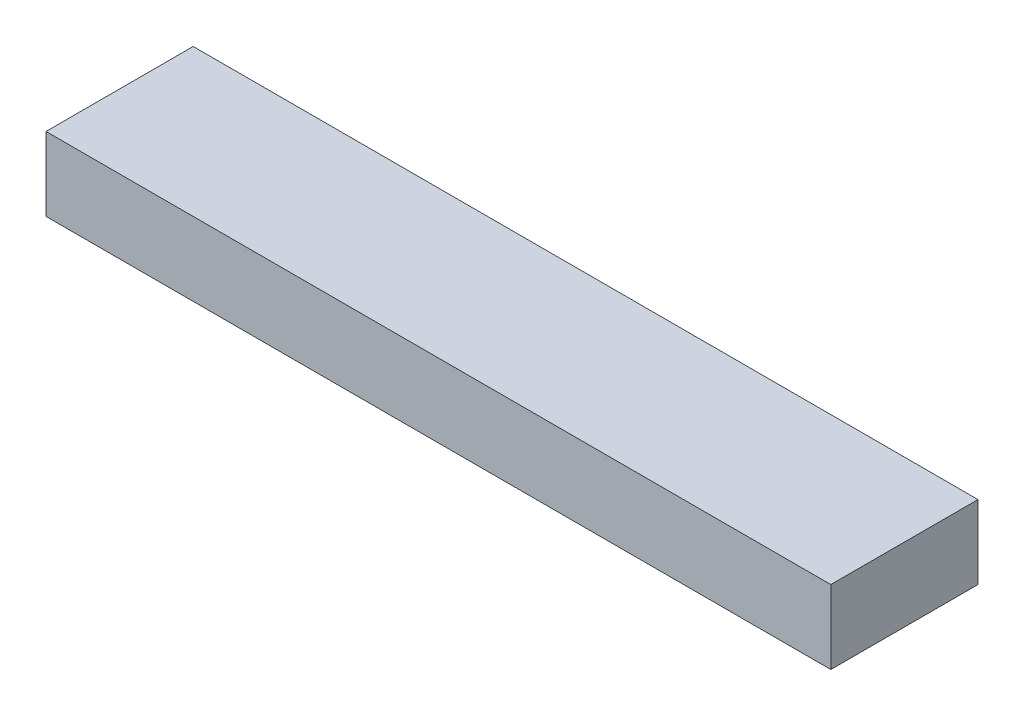
ISO-10303-21;
HEADER;
FILE_DESCRIPTION(('STEP AP214'),'2;1');
FILE_NAME('part.step','',(''),(''),'','','');
FILE_SCHEMA(('AUTOMOTIVE_DESIGN { 1 0 10303 214 1 1 1 1 }'));
ENDSEC;
DATA;
#1=APPLICATION_CONTEXT('core data for automotive mechanical design processes');
#2=APPLICATION_PROTOCOL_DEFINITION('international standard','automotive_design',2000,#1);
#3=PRODUCT_CONTEXT('',#1,'mechanical');
#4=PRODUCT('Part','Part','',(#3));
#5=PRODUCT_RELATED_PRODUCT_CATEGORY('part','',(#4));
#6=PRODUCT_DEFINITION_FORMATION('','',#4);
#7=PRODUCT_DEFINITION_CONTEXT('part definition',#1,'design');
#8=PRODUCT_DEFINITION('design','',#6,#7);
#9=PRODUCT_DEFINITION_SHAPE('','',#8);
#10=(LENGTH_UNIT() NAMED_UNIT(*) SI_UNIT(.MILLI.,.METRE.));
#11=(NAMED_UNIT(*) PLANE_ANGLE_UNIT() SI_UNIT($,.RADIAN.));
#12=(NAMED_UNIT(*) SI_UNIT($,.STERADIAN.) SOLID_ANGLE_UNIT());
#13=UNCERTAINTY_MEASURE_WITH_UNIT(LENGTH_MEASURE(1.E-05),#10,'distance_accuracy_value','');
#14=(GEOMETRIC_REPRESENTATION_CONTEXT(3) GLOBAL_UNCERTAINTY_ASSIGNED_CONTEXT((#13)) GLOBAL_UNIT_ASSIGNED_CONTEXT((#10,
#11,#12)) REPRESENTATION_CONTEXT('',''));
#15=CARTESIAN_POINT('',(0.,0.,0.));
#16=DIRECTION('',(0.,0.,1.));
#17=DIRECTION('',(1.,0.,0.));
#18=AXIS2_PLACEMENT_3D('',#15,#16,#17);
#19=CARTESIAN_POINT('',(270.8652063,50.8,50.8));
#20=DIRECTION('',(-1.,0.,0.));
#21=DIRECTION('',(0.,0.,1.));
#22=AXIS2_PLACEMENT_3D('',#19,#20,#21);
#23=PLANE('',#22);
#24=DIRECTION('',(0.,0.,-1.));
#25=VECTOR('',#24,1.);
#26=CARTESIAN_POINT('',(270.8652063,0.,50.8));
#27=LINE('',#26,#25);
#28=CARTESIAN_POINT('',(270.8652063,0.,50.8));
#29=VERTEX_POINT('',#28);
#30=CARTESIAN_POINT('',(270.8652063,0.,-50.8));
#31=VERTEX_POINT('',#30);
#32=EDGE_CURVE('E98',#29,#31,#27,.T.);
#33=ORIENTED_EDGE('',*,*,#32,.T.);
#34=DIRECTION('',(0.,-1.,0.));
#35=VECTOR('',#34,1.);
#36=CARTESIAN_POINT('',(270.8652063,50.8,-50.8));
#37=LINE('',#36,#35);
#38=CARTESIAN_POINT('',(270.8652063,50.8,-50.8));
#39=VERTEX_POINT('',#38);
#40=EDGE_CURVE('E11',#39,#31,#37,.T.);
#41=ORIENTED_EDGE('',*,*,#40,.F.);
#42=DIRECTION('',(0.,0.,-1.));
#43=VECTOR('',#42,1.);
#44=CARTESIAN_POINT('',(270.8652063,50.8,50.8));
#45=LINE('',#44,#43);
#46=CARTESIAN_POINT('',(270.8652063,50.8,50.8));
#47=VERTEX_POINT('',#46);
#48=EDGE_CURVE('E86',#47,#39,#45,.T.);
#49=ORIENTED_EDGE('',*,*,#48,.F.);
#50=DIRECTION('',(0.,-1.,0.));
#51=VECTOR('',#50,1.);
#52=CARTESIAN_POINT('',(270.8652063,50.8,50.8));
#53=LINE('',#52,#51);
#54=EDGE_CURVE('E94',#47,#29,#53,.T.);
#55=ORIENTED_EDGE('',*,*,#54,.T.);
#56=EDGE_LOOP('',(#33,#41,#49,#55));
#57=FACE_BOUND('',#56,.T.);
#58=ADVANCED_FACE('F35',(#57),#23,.F.);
#59=CARTESIAN_POINT('',(-270.8652063,50.8,-50.8));
#60=DIRECTION('',(0.,0.,1.));
#61=DIRECTION('',(1.,0.,0.));
#62=AXIS2_PLACEMENT_3D('',#59,#60,#61);
#63=PLANE('',#62);
#64=DIRECTION('',(-1.,0.,0.));
#65=VECTOR('',#64,1.);
#66=CARTESIAN_POINT('',(-270.8652063,0.,-50.8));
#67=LINE('',#66,#65);
#68=CARTESIAN_POINT('',(-270.8652063,0.,-50.8));
#69=VERTEX_POINT('',#68);
#70=EDGE_CURVE('E90',#31,#69,#67,.T.);
#71=ORIENTED_EDGE('',*,*,#70,.T.);
#72=DIRECTION('',(0.,-1.,0.));
#73=VECTOR('',#72,1.);
#74=CARTESIAN_POINT('',(-270.8652063,50.8,-50.8));
#75=LINE('',#74,#73);
#76=CARTESIAN_POINT('',(-270.8652063,50.8,-50.8));
#77=VERTEX_POINT('',#76);
#78=EDGE_CURVE('E43',#77,#69,#75,.T.);
#79=ORIENTED_EDGE('',*,*,#78,.F.);
#80=DIRECTION('',(-1.,0.,0.));
#81=VECTOR('',#80,1.);
#82=CARTESIAN_POINT('',(-270.8652063,50.8,-50.8));
#83=LINE('',#82,#81);
#84=EDGE_CURVE('E81',#39,#77,#83,.T.);
#85=ORIENTED_EDGE('',*,*,#84,.F.);
#86=ORIENTED_EDGE('',*,*,#40,.T.);
#87=EDGE_LOOP('',(#71,#79,#85,#86));
#88=FACE_BOUND('',#87,.T.);
#89=ADVANCED_FACE('F89',(#88),#63,.F.);
#90=CARTESIAN_POINT('',(-270.8652063,50.8,50.8));
#91=DIRECTION('',(1.,0.,0.));
#92=DIRECTION('',(0.,0.,-1.));
#93=AXIS2_PLACEMENT_3D('',#90,#91,#92);
#94=PLANE('',#93);
#95=DIRECTION('',(0.,0.,1.));
#96=VECTOR('',#95,1.);
#97=CARTESIAN_POINT('',(-270.8652063,0.,50.8));
#98=LINE('',#97,#96);
#99=CARTESIAN_POINT('',(-270.8652063,0.,50.8));
#100=VERTEX_POINT('',#99);
#101=EDGE_CURVE('E68',#69,#100,#98,.T.);
#102=ORIENTED_EDGE('',*,*,#101,.T.);
#103=DIRECTION('',(0.,-1.,0.));
#104=VECTOR('',#103,1.);
#105=CARTESIAN_POINT('',(-270.8652063,50.8,50.8));
#106=LINE('',#105,#104);
#107=CARTESIAN_POINT('',(-270.8652063,50.8,50.8));
#108=VERTEX_POINT('',#107);
#109=EDGE_CURVE('E91',#108,#100,#106,.T.);
#110=ORIENTED_EDGE('',*,*,#109,.F.);
#111=DIRECTION('',(0.,0.,1.));
#112=VECTOR('',#111,1.);
#113=CARTESIAN_POINT('',(-270.8652063,50.8,50.8));
#114=LINE('',#113,#112);
#115=EDGE_CURVE('E84',#77,#108,#114,.T.);
#116=ORIENTED_EDGE('',*,*,#115,.F.);
#117=ORIENTED_EDGE('',*,*,#78,.T.);
#118=EDGE_LOOP('',(#102,#110,#116,#117));
#119=FACE_BOUND('',#118,.T.);
#120=ADVANCED_FACE('F92',(#119),#94,.F.);
#121=CARTESIAN_POINT('',(-270.8652063,50.8,50.8));
#122=DIRECTION('',(0.,0.,-1.));
#123=DIRECTION('',(-1.,0.,0.));
#124=AXIS2_PLACEMENT_3D('',#121,#122,#123);
#125=PLANE('',#124);
#126=DIRECTION('',(1.,0.,0.));
#127=VECTOR('',#126,1.);
#128=CARTESIAN_POINT('',(-270.8652063,0.,50.8));
#129=LINE('',#128,#127);
#130=EDGE_CURVE('E74',#100,#29,#129,.T.);
#131=ORIENTED_EDGE('',*,*,#130,.T.);
#132=ORIENTED_EDGE('',*,*,#54,.F.);
#133=DIRECTION('',(1.,0.,0.));
#134=VECTOR('',#133,1.);
#135=CARTESIAN_POINT('',(-270.8652063,50.8,50.8));
#136=LINE('',#135,#134);
#137=EDGE_CURVE('E51',#108,#47,#136,.T.);
#138=ORIENTED_EDGE('',*,*,#137,.F.);
#139=ORIENTED_EDGE('',*,*,#109,.T.);
#140=EDGE_LOOP('',(#131,#132,#138,#139));
#141=FACE_BOUND('',#140,.T.);
#142=ADVANCED_FACE('F105',(#141),#125,.F.);
#143=CARTESIAN_POINT('',(0.,50.8,0.));
#144=DIRECTION('',(0.,-1.,0.));
#145=DIRECTION('',(0.,0.,-1.));
#146=AXIS2_PLACEMENT_3D('',#143,#144,#145);
#147=PLANE('',#146);
#148=ORIENTED_EDGE('',*,*,#48,.T.);
#149=ORIENTED_EDGE('',*,*,#84,.T.);
#150=ORIENTED_EDGE('',*,*,#115,.T.);
#151=ORIENTED_EDGE('',*,*,#137,.T.);
#152=EDGE_LOOP('',(#148,#149,#150,#151));
#153=FACE_BOUND('',#152,.T.);
#154=ADVANCED_FACE('F82',(#153),#147,.F.);
#155=CARTESIAN_POINT('',(0.,0.,0.));
#156=DIRECTION('',(0.,-1.,0.));
#157=DIRECTION('',(0.,0.,-1.));
#158=AXIS2_PLACEMENT_3D('',#155,#156,#157);
#159=PLANE('',#158);
#160=ORIENTED_EDGE('',*,*,#32,.F.);
#161=ORIENTED_EDGE('',*,*,#130,.F.);
#162=ORIENTED_EDGE('',*,*,#101,.F.);
#163=ORIENTED_EDGE('',*,*,#70,.F.);
#164=EDGE_LOOP('',(#160,#161,#162,#163));
#165=FACE_BOUND('',#164,.T.);
#166=ADVANCED_FACE('F108',(#165),#159,.T.);
#167=CLOSED_SHELL('',(#58,#89,#120,#142,#154,#166));
#168=MANIFOLD_SOLID_BREP('B2',#167);
#169=ADVANCED_BREP_SHAPE_REPRESENTATION('',(#18,#168),#14);
#170=SHAPE_DEFINITION_REPRESENTATION(#9,#169);
ENDSEC;
END-ISO-10303-21;
